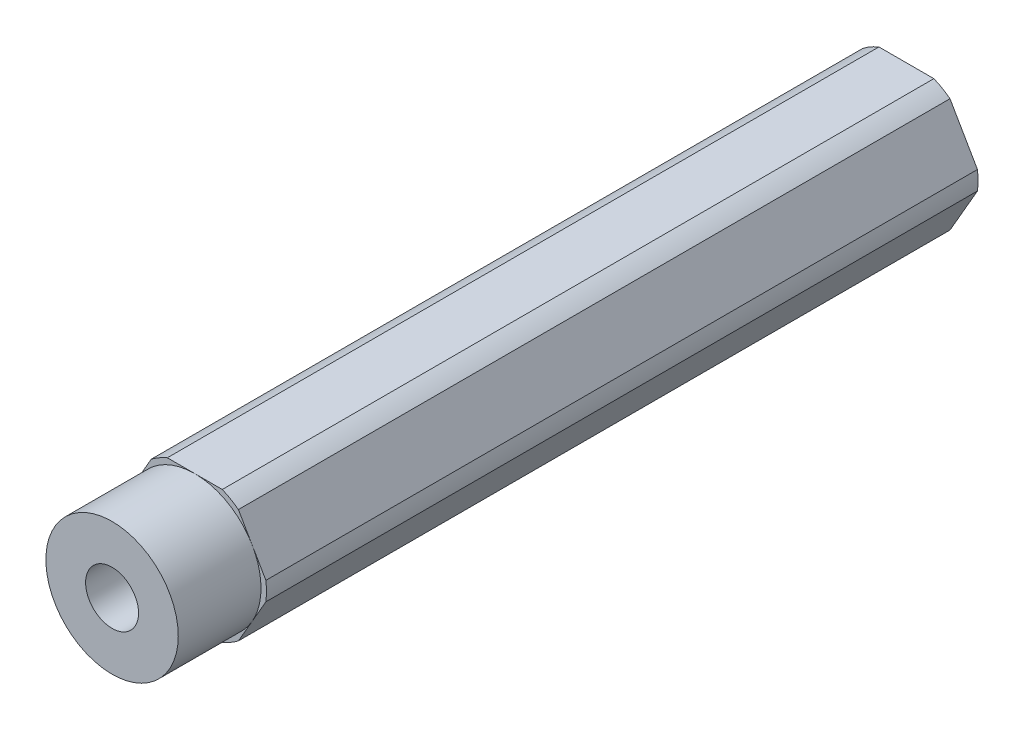
ISO-10303-21;
HEADER;
FILE_DESCRIPTION(('STEP AP214'),'2;1');
FILE_NAME('part.step','',(''),(''),'','','');
FILE_SCHEMA(('AUTOMOTIVE_DESIGN { 1 0 10303 214 1 1 1 1 }'));
ENDSEC;
DATA;
#1=APPLICATION_CONTEXT('core data for automotive mechanical design processes');
#2=APPLICATION_PROTOCOL_DEFINITION('international standard','automotive_design',2000,#1);
#3=PRODUCT_CONTEXT('',#1,'mechanical');
#4=PRODUCT('Part','Part','',(#3));
#5=PRODUCT_RELATED_PRODUCT_CATEGORY('part','',(#4));
#6=PRODUCT_DEFINITION_FORMATION('','',#4);
#7=PRODUCT_DEFINITION_CONTEXT('part definition',#1,'design');
#8=PRODUCT_DEFINITION('design','',#6,#7);
#9=PRODUCT_DEFINITION_SHAPE('','',#8);
#10=(LENGTH_UNIT() NAMED_UNIT(*) SI_UNIT(.MILLI.,.METRE.));
#11=(NAMED_UNIT(*) PLANE_ANGLE_UNIT() SI_UNIT($,.RADIAN.));
#12=(NAMED_UNIT(*) SI_UNIT($,.STERADIAN.) SOLID_ANGLE_UNIT());
#13=UNCERTAINTY_MEASURE_WITH_UNIT(LENGTH_MEASURE(1.E-05),#10,'distance_accuracy_value','');
#14=(GEOMETRIC_REPRESENTATION_CONTEXT(3) GLOBAL_UNCERTAINTY_ASSIGNED_CONTEXT((#13)) GLOBAL_UNIT_ASSIGNED_CONTEXT((#10,
#11,#12)) REPRESENTATION_CONTEXT('',''));
#15=CARTESIAN_POINT('',(0.,0.,0.));
#16=DIRECTION('',(0.,0.,1.));
#17=DIRECTION('',(1.,0.,0.));
#18=AXIS2_PLACEMENT_3D('',#15,#16,#17);
#19=CARTESIAN_POINT('',(0.,0.,76.2));
#20=DIRECTION('',(0.,0.,1.));
#21=DIRECTION('',(1.,0.,0.));
#22=AXIS2_PLACEMENT_3D('',#19,#20,#21);
#23=PLANE('',#22);
#24=CARTESIAN_POINT('',(0.,0.,76.2));
#25=DIRECTION('',(0.,0.,1.));
#26=DIRECTION('',(1.,0.,0.));
#27=AXIS2_PLACEMENT_3D('',#24,#25,#26);
#28=CIRCLE('',#27,2.54);
#29=CARTESIAN_POINT('',(2.54,0.,76.2));
#30=VERTEX_POINT('',#29);
#31=EDGE_CURVE('E195',#30,#30,#28,.T.);
#32=ORIENTED_EDGE('',*,*,#31,.F.);
#33=EDGE_LOOP('',(#32));
#34=FACE_BOUND('',#33,.T.);
#35=CARTESIAN_POINT('',(0.,0.,76.2));
#36=DIRECTION('',(0.,0.,1.));
#37=DIRECTION('',(1.,0.,0.));
#38=AXIS2_PLACEMENT_3D('',#35,#36,#37);
#39=CIRCLE('',#38,6.35);
#40=CARTESIAN_POINT('',(6.35,0.,76.2));
#41=VERTEX_POINT('',#40);
#42=EDGE_CURVE('E165',#41,#41,#39,.T.);
#43=ORIENTED_EDGE('',*,*,#42,.T.);
#44=EDGE_LOOP('',(#43));
#45=FACE_BOUND('',#44,.T.);
#46=ADVANCED_FACE('F34',(#34,#45),#23,.T.);
#47=CARTESIAN_POINT('',(0.,0.,76.2));
#48=DIRECTION('',(0.,0.,-1.));
#49=DIRECTION('',(-1.,0.,0.));
#50=AXIS2_PLACEMENT_3D('',#47,#48,#49);
#51=CYLINDRICAL_SURFACE('',#50,6.875);
#52=CARTESIAN_POINT('',(0.,0.,68.2625));
#53=DIRECTION('',(0.,0.,1.));
#54=DIRECTION('',(1.,0.,0.));
#55=AXIS2_PLACEMENT_3D('',#52,#53,#54);
#56=CIRCLE('',#55,6.875);
#57=CARTESIAN_POINT('',(-4.18177080173138,-5.45696050579321,68.2625));
#58=VERTEX_POINT('',#57);
#59=CARTESIAN_POINT('',(-2.63498102459961,-6.35,68.2625));
#60=VERTEX_POINT('',#59);
#61=EDGE_CURVE('E192',#58,#60,#56,.T.);
#62=ORIENTED_EDGE('',*,*,#61,.F.);
#63=DIRECTION('',(0.,0.,-1.));
#64=VECTOR('',#63,1.);
#65=CARTESIAN_POINT('',(-4.18177080173138,-5.45696050579321,76.2));
#66=LINE('',#65,#64);
#67=CARTESIAN_POINT('',(-4.18177080173138,-5.45696050579321,0.));
#68=VERTEX_POINT('',#67);
#69=EDGE_CURVE('E57',#58,#68,#66,.T.);
#70=ORIENTED_EDGE('',*,*,#69,.T.);
#71=CARTESIAN_POINT('',(0.,0.,0.));
#72=DIRECTION('',(0.,0.,1.));
#73=DIRECTION('',(1.,0.,0.));
#74=AXIS2_PLACEMENT_3D('',#71,#72,#73);
#75=CIRCLE('',#74,6.875);
#76=CARTESIAN_POINT('',(-2.63498102459961,-6.35,0.));
#77=VERTEX_POINT('',#76);
#78=EDGE_CURVE('E198',#68,#77,#75,.T.);
#79=ORIENTED_EDGE('',*,*,#78,.T.);
#80=DIRECTION('',(0.,0.,-1.));
#81=VECTOR('',#80,1.);
#82=CARTESIAN_POINT('',(-2.63498102459961,-6.35,76.2));
#83=LINE('',#82,#81);
#84=EDGE_CURVE('E252',#60,#77,#83,.T.);
#85=ORIENTED_EDGE('',*,*,#84,.F.);
#86=EDGE_LOOP('',(#62,#70,#79,#85));
#87=FACE_BOUND('',#86,.T.);
#88=ADVANCED_FACE('F36',(#87),#51,.T.);
#89=CARTESIAN_POINT('',(-2.63498102459961,-6.35,76.2));
#90=DIRECTION('',(0.,1.,0.));
#91=DIRECTION('',(-1.,0.,0.));
#92=AXIS2_PLACEMENT_3D('',#89,#90,#91);
#93=PLANE('',#92);
#94=DIRECTION('',(1.,0.,0.));
#95=VECTOR('',#94,1.);
#96=CARTESIAN_POINT('',(-2.63498102459961,-6.35,68.2625));
#97=LINE('',#96,#95);
#98=CARTESIAN_POINT('',(0.,-6.35,68.2625));
#99=VERTEX_POINT('',#98);
#100=EDGE_CURVE('E191',#60,#99,#97,.T.);
#101=ORIENTED_EDGE('',*,*,#100,.F.);
#102=ORIENTED_EDGE('',*,*,#84,.T.);
#103=DIRECTION('',(1.,0.,0.));
#104=VECTOR('',#103,1.);
#105=CARTESIAN_POINT('',(-2.63498102459961,-6.35,0.));
#106=LINE('',#105,#104);
#107=CARTESIAN_POINT('',(2.63498102459961,-6.35,0.));
#108=VERTEX_POINT('',#107);
#109=EDGE_CURVE('E202',#77,#108,#106,.T.);
#110=ORIENTED_EDGE('',*,*,#109,.T.);
#111=DIRECTION('',(0.,0.,-1.));
#112=VECTOR('',#111,1.);
#113=CARTESIAN_POINT('',(2.63498102459961,-6.35,76.2));
#114=LINE('',#113,#112);
#115=CARTESIAN_POINT('',(2.63498102459961,-6.35,68.2625));
#116=VERTEX_POINT('',#115);
#117=EDGE_CURVE('E251',#116,#108,#114,.T.);
#118=ORIENTED_EDGE('',*,*,#117,.F.);
#119=EDGE_CURVE('E189',#99,#116,#97,.T.);
#120=ORIENTED_EDGE('',*,*,#119,.F.);
#121=EDGE_LOOP('',(#101,#102,#110,#118,#120));
#122=FACE_BOUND('',#121,.T.);
#123=ADVANCED_FACE('F274',(#122),#93,.F.);
#124=CARTESIAN_POINT('',(0.,0.,76.2));
#125=DIRECTION('',(0.,0.,-1.));
#126=DIRECTION('',(-1.,0.,0.));
#127=AXIS2_PLACEMENT_3D('',#124,#125,#126);
#128=CYLINDRICAL_SURFACE('',#127,6.875);
#129=CARTESIAN_POINT('',(0.,0.,68.2625));
#130=DIRECTION('',(0.,0.,1.));
#131=DIRECTION('',(1.,0.,0.));
#132=AXIS2_PLACEMENT_3D('',#129,#130,#131);
#133=CIRCLE('',#132,6.875);
#134=CARTESIAN_POINT('',(4.18177080173138,-5.45696050579321,68.2625));
#135=VERTEX_POINT('',#134);
#136=EDGE_CURVE('E187',#116,#135,#133,.T.);
#137=ORIENTED_EDGE('',*,*,#136,.F.);
#138=ORIENTED_EDGE('',*,*,#117,.T.);
#139=CARTESIAN_POINT('',(0.,0.,0.));
#140=DIRECTION('',(0.,0.,1.));
#141=DIRECTION('',(1.,0.,0.));
#142=AXIS2_PLACEMENT_3D('',#139,#140,#141);
#143=CIRCLE('',#142,6.875);
#144=CARTESIAN_POINT('',(4.18177080173138,-5.45696050579321,0.));
#145=VERTEX_POINT('',#144);
#146=EDGE_CURVE('E205',#108,#145,#143,.T.);
#147=ORIENTED_EDGE('',*,*,#146,.T.);
#148=DIRECTION('',(0.,0.,-1.));
#149=VECTOR('',#148,1.);
#150=CARTESIAN_POINT('',(4.18177080173138,-5.45696050579321,76.2));
#151=LINE('',#150,#149);
#152=EDGE_CURVE('E249',#135,#145,#151,.T.);
#153=ORIENTED_EDGE('',*,*,#152,.F.);
#154=EDGE_LOOP('',(#137,#138,#147,#153));
#155=FACE_BOUND('',#154,.T.);
#156=ADVANCED_FACE('F278',(#155),#128,.T.);
#157=CARTESIAN_POINT('',(4.18177080173138,-5.45696050579321,76.2));
#158=DIRECTION('',(-0.866025403784439,0.5,0.));
#159=DIRECTION('',(-0.5,-0.866025403784439,0.));
#160=AXIS2_PLACEMENT_3D('',#157,#158,#159);
#161=PLANE('',#160);
#162=DIRECTION('',(0.5,0.866025403784439,0.));
#163=VECTOR('',#162,1.);
#164=CARTESIAN_POINT('',(4.18177080173138,-5.45696050579321,68.2625));
#165=LINE('',#164,#163);
#166=CARTESIAN_POINT('',(5.49926131403119,-3.175,68.2625));
#167=VERTEX_POINT('',#166);
#168=EDGE_CURVE('E186',#135,#167,#165,.T.);
#169=ORIENTED_EDGE('',*,*,#168,.F.);
#170=ORIENTED_EDGE('',*,*,#152,.T.);
#171=DIRECTION('',(0.5,0.866025403784439,0.));
#172=VECTOR('',#171,1.);
#173=CARTESIAN_POINT('',(4.18177080173138,-5.45696050579321,0.));
#174=LINE('',#173,#172);
#175=CARTESIAN_POINT('',(6.81675182633099,-0.89303949420679,0.));
#176=VERTEX_POINT('',#175);
#177=EDGE_CURVE('E208',#145,#176,#174,.T.);
#178=ORIENTED_EDGE('',*,*,#177,.T.);
#179=DIRECTION('',(0.,0.,-1.));
#180=VECTOR('',#179,1.);
#181=CARTESIAN_POINT('',(6.81675182633099,-0.89303949420679,76.2));
#182=LINE('',#181,#180);
#183=CARTESIAN_POINT('',(6.81675182633099,-0.89303949420679,68.2625));
#184=VERTEX_POINT('',#183);
#185=EDGE_CURVE('E247',#184,#176,#182,.T.);
#186=ORIENTED_EDGE('',*,*,#185,.F.);
#187=EDGE_CURVE('E184',#167,#184,#165,.T.);
#188=ORIENTED_EDGE('',*,*,#187,.F.);
#189=EDGE_LOOP('',(#169,#170,#178,#186,#188));
#190=FACE_BOUND('',#189,.T.);
#191=ADVANCED_FACE('F284',(#190),#161,.F.);
#192=CARTESIAN_POINT('',(0.,0.,76.2));
#193=DIRECTION('',(0.,0.,-1.));
#194=DIRECTION('',(-1.,0.,0.));
#195=AXIS2_PLACEMENT_3D('',#192,#193,#194);
#196=CYLINDRICAL_SURFACE('',#195,6.875);
#197=CARTESIAN_POINT('',(0.,0.,68.2625));
#198=DIRECTION('',(0.,0.,1.));
#199=DIRECTION('',(1.,0.,0.));
#200=AXIS2_PLACEMENT_3D('',#197,#198,#199);
#201=CIRCLE('',#200,6.875);
#202=CARTESIAN_POINT('',(6.81675182633099,0.893039494206786,68.2625));
#203=VERTEX_POINT('',#202);
#204=EDGE_CURVE('E151',#184,#203,#201,.T.);
#205=ORIENTED_EDGE('',*,*,#204,.F.);
#206=ORIENTED_EDGE('',*,*,#185,.T.);
#207=CARTESIAN_POINT('',(0.,0.,0.));
#208=DIRECTION('',(0.,0.,1.));
#209=DIRECTION('',(1.,0.,0.));
#210=AXIS2_PLACEMENT_3D('',#207,#208,#209);
#211=CIRCLE('',#210,6.875);
#212=CARTESIAN_POINT('',(6.81675182633099,0.893039494206786,0.));
#213=VERTEX_POINT('',#212);
#214=EDGE_CURVE('E211',#176,#213,#211,.T.);
#215=ORIENTED_EDGE('',*,*,#214,.T.);
#216=DIRECTION('',(0.,0.,-1.));
#217=VECTOR('',#216,1.);
#218=CARTESIAN_POINT('',(6.81675182633099,0.893039494206786,76.2));
#219=LINE('',#218,#217);
#220=EDGE_CURVE('E245',#203,#213,#219,.T.);
#221=ORIENTED_EDGE('',*,*,#220,.F.);
#222=EDGE_LOOP('',(#205,#206,#215,#221));
#223=FACE_BOUND('',#222,.T.);
#224=ADVANCED_FACE('F287',(#223),#196,.T.);
#225=CARTESIAN_POINT('',(6.81675182633099,0.893039494206785,76.2));
#226=DIRECTION('',(-0.866025403784439,-0.5,0.));
#227=DIRECTION('',(0.5,-0.866025403784439,0.));
#228=AXIS2_PLACEMENT_3D('',#225,#226,#227);
#229=PLANE('',#228);
#230=DIRECTION('',(-0.5,0.866025403784439,0.));
#231=VECTOR('',#230,1.);
#232=CARTESIAN_POINT('',(6.81675182633099,0.893039494206785,68.2625));
#233=LINE('',#232,#231);
#234=CARTESIAN_POINT('',(5.49926131403118,3.175,68.2625));
#235=VERTEX_POINT('',#234);
#236=EDGE_CURVE('E145',#203,#235,#233,.T.);
#237=ORIENTED_EDGE('',*,*,#236,.F.);
#238=ORIENTED_EDGE('',*,*,#220,.T.);
#239=DIRECTION('',(-0.5,0.866025403784438,0.));
#240=VECTOR('',#239,1.);
#241=CARTESIAN_POINT('',(6.81675182633099,0.893039494206785,0.));
#242=LINE('',#241,#240);
#243=CARTESIAN_POINT('',(4.18177080173138,5.45696050579321,0.));
#244=VERTEX_POINT('',#243);
#245=EDGE_CURVE('E214',#213,#244,#242,.T.);
#246=ORIENTED_EDGE('',*,*,#245,.T.);
#247=DIRECTION('',(0.,0.,-1.));
#248=VECTOR('',#247,1.);
#249=CARTESIAN_POINT('',(4.18177080173138,5.45696050579321,76.2));
#250=LINE('',#249,#248);
#251=CARTESIAN_POINT('',(4.18177080173138,5.45696050579321,68.2625));
#252=VERTEX_POINT('',#251);
#253=EDGE_CURVE('E178',#252,#244,#250,.T.);
#254=ORIENTED_EDGE('',*,*,#253,.F.);
#255=EDGE_CURVE('E155',#235,#252,#233,.T.);
#256=ORIENTED_EDGE('',*,*,#255,.F.);
#257=EDGE_LOOP('',(#237,#238,#246,#254,#256));
#258=FACE_BOUND('',#257,.T.);
#259=ADVANCED_FACE('F176',(#258),#229,.F.);
#260=CARTESIAN_POINT('',(0.,0.,76.2));
#261=DIRECTION('',(0.,0.,-1.));
#262=DIRECTION('',(-1.,0.,0.));
#263=AXIS2_PLACEMENT_3D('',#260,#261,#262);
#264=CYLINDRICAL_SURFACE('',#263,6.875);
#265=CARTESIAN_POINT('',(0.,0.,68.2625));
#266=DIRECTION('',(0.,0.,1.));
#267=DIRECTION('',(1.,0.,0.));
#268=AXIS2_PLACEMENT_3D('',#265,#266,#267);
#269=CIRCLE('',#268,6.875);
#270=CARTESIAN_POINT('',(2.63498102459961,6.35,68.2625));
#271=VERTEX_POINT('',#270);
#272=EDGE_CURVE('E179',#252,#271,#269,.T.);
#273=ORIENTED_EDGE('',*,*,#272,.F.);
#274=ORIENTED_EDGE('',*,*,#253,.T.);
#275=CARTESIAN_POINT('',(0.,0.,0.));
#276=DIRECTION('',(0.,0.,1.));
#277=DIRECTION('',(1.,0.,0.));
#278=AXIS2_PLACEMENT_3D('',#275,#276,#277);
#279=CIRCLE('',#278,6.875);
#280=CARTESIAN_POINT('',(2.63498102459961,6.35,0.));
#281=VERTEX_POINT('',#280);
#282=EDGE_CURVE('E216',#244,#281,#279,.T.);
#283=ORIENTED_EDGE('',*,*,#282,.T.);
#284=DIRECTION('',(0.,0.,-1.));
#285=VECTOR('',#284,1.);
#286=CARTESIAN_POINT('',(2.63498102459961,6.35,76.2));
#287=LINE('',#286,#285);
#288=EDGE_CURVE('E242',#271,#281,#287,.T.);
#289=ORIENTED_EDGE('',*,*,#288,.F.);
#290=EDGE_LOOP('',(#273,#274,#283,#289));
#291=FACE_BOUND('',#290,.T.);
#292=ADVANCED_FACE('F295',(#291),#264,.T.);
#293=CARTESIAN_POINT('',(2.63498102459961,6.35,76.2));
#294=DIRECTION('',(0.,-1.,0.));
#295=DIRECTION('',(0.,0.,-1.));
#296=AXIS2_PLACEMENT_3D('',#293,#294,#295);
#297=PLANE('',#296);
#298=DIRECTION('',(-1.,0.,0.));
#299=VECTOR('',#298,1.);
#300=CARTESIAN_POINT('',(2.63498102459961,6.35,68.2625));
#301=LINE('',#300,#299);
#302=CARTESIAN_POINT('',(0.,6.35,68.2625));
#303=VERTEX_POINT('',#302);
#304=EDGE_CURVE('E171',#271,#303,#301,.T.);
#305=ORIENTED_EDGE('',*,*,#304,.F.);
#306=ORIENTED_EDGE('',*,*,#288,.T.);
#307=DIRECTION('',(-1.,0.,0.));
#308=VECTOR('',#307,1.);
#309=CARTESIAN_POINT('',(2.63498102459961,6.35,0.));
#310=LINE('',#309,#308);
#311=CARTESIAN_POINT('',(-2.63498102459961,6.35,0.));
#312=VERTEX_POINT('',#311);
#313=EDGE_CURVE('E219',#281,#312,#310,.T.);
#314=ORIENTED_EDGE('',*,*,#313,.T.);
#315=DIRECTION('',(0.,0.,-1.));
#316=VECTOR('',#315,1.);
#317=CARTESIAN_POINT('',(-2.63498102459961,6.35,76.2));
#318=LINE('',#317,#316);
#319=CARTESIAN_POINT('',(-2.63498102459961,6.35,68.2625));
#320=VERTEX_POINT('',#319);
#321=EDGE_CURVE('E240',#320,#312,#318,.T.);
#322=ORIENTED_EDGE('',*,*,#321,.F.);
#323=EDGE_CURVE('E299',#303,#320,#301,.T.);
#324=ORIENTED_EDGE('',*,*,#323,.F.);
#325=EDGE_LOOP('',(#305,#306,#314,#322,#324));
#326=FACE_BOUND('',#325,.T.);
#327=ADVANCED_FACE('F297',(#326),#297,.F.);
#328=CARTESIAN_POINT('',(0.,0.,76.2));
#329=DIRECTION('',(0.,0.,-1.));
#330=DIRECTION('',(-1.,0.,0.));
#331=AXIS2_PLACEMENT_3D('',#328,#329,#330);
#332=CYLINDRICAL_SURFACE('',#331,6.875);
#333=CARTESIAN_POINT('',(0.,0.,68.2625));
#334=DIRECTION('',(0.,0.,1.));
#335=DIRECTION('',(1.,0.,0.));
#336=AXIS2_PLACEMENT_3D('',#333,#334,#335);
#337=CIRCLE('',#336,6.875);
#338=CARTESIAN_POINT('',(-4.18177080173138,5.45696050579321,68.2625));
#339=VERTEX_POINT('',#338);
#340=EDGE_CURVE('E300',#320,#339,#337,.T.);
#341=ORIENTED_EDGE('',*,*,#340,.F.);
#342=ORIENTED_EDGE('',*,*,#321,.T.);
#343=CARTESIAN_POINT('',(0.,0.,0.));
#344=DIRECTION('',(0.,0.,1.));
#345=DIRECTION('',(1.,0.,0.));
#346=AXIS2_PLACEMENT_3D('',#343,#344,#345);
#347=CIRCLE('',#346,6.875);
#348=CARTESIAN_POINT('',(-4.18177080173138,5.45696050579321,0.));
#349=VERTEX_POINT('',#348);
#350=EDGE_CURVE('E222',#312,#349,#347,.T.);
#351=ORIENTED_EDGE('',*,*,#350,.T.);
#352=DIRECTION('',(0.,0.,-1.));
#353=VECTOR('',#352,1.);
#354=CARTESIAN_POINT('',(-4.18177080173138,5.45696050579321,76.2));
#355=LINE('',#354,#353);
#356=EDGE_CURVE('E238',#339,#349,#355,.T.);
#357=ORIENTED_EDGE('',*,*,#356,.F.);
#358=EDGE_LOOP('',(#341,#342,#351,#357));
#359=FACE_BOUND('',#358,.T.);
#360=ADVANCED_FACE('F342',(#359),#332,.T.);
#361=CARTESIAN_POINT('',(-4.18177080173138,5.45696050579321,76.2));
#362=DIRECTION('',(0.866025403784439,-0.5,0.));
#363=DIRECTION('',(0.5,0.866025403784438,0.));
#364=AXIS2_PLACEMENT_3D('',#361,#362,#363);
#365=PLANE('',#364);
#366=DIRECTION('',(-0.5,-0.866025403784438,0.));
#367=VECTOR('',#366,1.);
#368=CARTESIAN_POINT('',(-4.18177080173138,5.45696050579321,68.2625));
#369=LINE('',#368,#367);
#370=CARTESIAN_POINT('',(-5.49926131403118,3.175,68.2625));
#371=VERTEX_POINT('',#370);
#372=EDGE_CURVE('E303',#339,#371,#369,.T.);
#373=ORIENTED_EDGE('',*,*,#372,.F.);
#374=ORIENTED_EDGE('',*,*,#356,.T.);
#375=DIRECTION('',(-0.5,-0.866025403784439,0.));
#376=VECTOR('',#375,1.);
#377=CARTESIAN_POINT('',(-4.18177080173138,5.45696050579321,0.));
#378=LINE('',#377,#376);
#379=CARTESIAN_POINT('',(-6.81675182633099,0.893039494206786,0.));
#380=VERTEX_POINT('',#379);
#381=EDGE_CURVE('E225',#349,#380,#378,.T.);
#382=ORIENTED_EDGE('',*,*,#381,.T.);
#383=DIRECTION('',(0.,0.,-1.));
#384=VECTOR('',#383,1.);
#385=CARTESIAN_POINT('',(-6.81675182633099,0.893039494206786,76.2));
#386=LINE('',#385,#384);
#387=CARTESIAN_POINT('',(-6.81675182633099,0.893039494206786,68.2625));
#388=VERTEX_POINT('',#387);
#389=EDGE_CURVE('E236',#388,#380,#386,.T.);
#390=ORIENTED_EDGE('',*,*,#389,.F.);
#391=EDGE_CURVE('E304',#371,#388,#369,.T.);
#392=ORIENTED_EDGE('',*,*,#391,.F.);
#393=EDGE_LOOP('',(#373,#374,#382,#390,#392));
#394=FACE_BOUND('',#393,.T.);
#395=ADVANCED_FACE('F338',(#394),#365,.F.);
#396=CARTESIAN_POINT('',(0.,0.,76.2));
#397=DIRECTION('',(0.,0.,-1.));
#398=DIRECTION('',(-1.,0.,0.));
#399=AXIS2_PLACEMENT_3D('',#396,#397,#398);
#400=CYLINDRICAL_SURFACE('',#399,6.875);
#401=CARTESIAN_POINT('',(0.,0.,68.2625));
#402=DIRECTION('',(0.,0.,1.));
#403=DIRECTION('',(1.,0.,0.));
#404=AXIS2_PLACEMENT_3D('',#401,#402,#403);
#405=CIRCLE('',#404,6.875);
#406=CARTESIAN_POINT('',(-6.81675182633099,-0.893039494206782,68.2625));
#407=VERTEX_POINT('',#406);
#408=EDGE_CURVE('E173',#388,#407,#405,.T.);
#409=ORIENTED_EDGE('',*,*,#408,.F.);
#410=ORIENTED_EDGE('',*,*,#389,.T.);
#411=CARTESIAN_POINT('',(0.,0.,0.));
#412=DIRECTION('',(0.,0.,1.));
#413=DIRECTION('',(1.,0.,0.));
#414=AXIS2_PLACEMENT_3D('',#411,#412,#413);
#415=CIRCLE('',#414,6.875);
#416=CARTESIAN_POINT('',(-6.81675182633099,-0.893039494206782,0.));
#417=VERTEX_POINT('',#416);
#418=EDGE_CURVE('E228',#380,#417,#415,.T.);
#419=ORIENTED_EDGE('',*,*,#418,.T.);
#420=DIRECTION('',(0.,0.,-1.));
#421=VECTOR('',#420,1.);
#422=CARTESIAN_POINT('',(-6.81675182633099,-0.893039494206782,76.2));
#423=LINE('',#422,#421);
#424=EDGE_CURVE('E234',#407,#417,#423,.T.);
#425=ORIENTED_EDGE('',*,*,#424,.F.);
#426=EDGE_LOOP('',(#409,#410,#419,#425));
#427=FACE_BOUND('',#426,.T.);
#428=ADVANCED_FACE('F335',(#427),#400,.T.);
#429=CARTESIAN_POINT('',(-6.81675182633099,-0.893039494206782,76.2));
#430=DIRECTION('',(0.866025403784439,0.5,0.));
#431=DIRECTION('',(-0.5,0.866025403784439,0.));
#432=AXIS2_PLACEMENT_3D('',#429,#430,#431);
#433=PLANE('',#432);
#434=DIRECTION('',(0.5,-0.866025403784439,0.));
#435=VECTOR('',#434,1.);
#436=CARTESIAN_POINT('',(-6.81675182633099,-0.893039494206782,68.2625));
#437=LINE('',#436,#435);
#438=CARTESIAN_POINT('',(-5.49926131403119,-3.175,68.2625));
#439=VERTEX_POINT('',#438);
#440=EDGE_CURVE('E12',#407,#439,#437,.T.);
#441=ORIENTED_EDGE('',*,*,#440,.F.);
#442=ORIENTED_EDGE('',*,*,#424,.T.);
#443=DIRECTION('',(0.5,-0.866025403784439,0.));
#444=VECTOR('',#443,1.);
#445=CARTESIAN_POINT('',(-6.81675182633099,-0.893039494206782,0.));
#446=LINE('',#445,#444);
#447=EDGE_CURVE('E231',#417,#68,#446,.T.);
#448=ORIENTED_EDGE('',*,*,#447,.T.);
#449=ORIENTED_EDGE('',*,*,#69,.F.);
#450=EDGE_CURVE('E38',#439,#58,#437,.T.);
#451=ORIENTED_EDGE('',*,*,#450,.F.);
#452=EDGE_LOOP('',(#441,#442,#448,#449,#451));
#453=FACE_BOUND('',#452,.T.);
#454=ADVANCED_FACE('F263',(#453),#433,.F.);
#455=CARTESIAN_POINT('',(0.,0.,0.));
#456=DIRECTION('',(0.,0.,1.));
#457=DIRECTION('',(1.,0.,0.));
#458=AXIS2_PLACEMENT_3D('',#455,#456,#457);
#459=PLANE('',#458);
#460=ORIENTED_EDGE('',*,*,#78,.F.);
#461=ORIENTED_EDGE('',*,*,#447,.F.);
#462=ORIENTED_EDGE('',*,*,#418,.F.);
#463=ORIENTED_EDGE('',*,*,#381,.F.);
#464=ORIENTED_EDGE('',*,*,#350,.F.);
#465=ORIENTED_EDGE('',*,*,#313,.F.);
#466=ORIENTED_EDGE('',*,*,#282,.F.);
#467=ORIENTED_EDGE('',*,*,#245,.F.);
#468=ORIENTED_EDGE('',*,*,#214,.F.);
#469=ORIENTED_EDGE('',*,*,#177,.F.);
#470=ORIENTED_EDGE('',*,*,#146,.F.);
#471=ORIENTED_EDGE('',*,*,#109,.F.);
#472=EDGE_LOOP('',(#460,#461,#462,#463,#464,#465,#466,#467,#468,#469,#470,#471));
#473=FACE_BOUND('',#472,.T.);
#474=CARTESIAN_POINT('',(0.,0.,0.));
#475=DIRECTION('',(0.,0.,1.));
#476=DIRECTION('',(1.,0.,0.));
#477=AXIS2_PLACEMENT_3D('',#474,#475,#476);
#478=CIRCLE('',#477,2.54);
#479=CARTESIAN_POINT('',(2.54,0.,0.));
#480=VERTEX_POINT('',#479);
#481=EDGE_CURVE('E194',#480,#480,#478,.T.);
#482=ORIENTED_EDGE('',*,*,#481,.T.);
#483=EDGE_LOOP('',(#482));
#484=FACE_BOUND('',#483,.T.);
#485=ADVANCED_FACE('F269',(#473,#484),#459,.F.);
#486=CARTESIAN_POINT('',(0.,0.,76.2));
#487=DIRECTION('',(0.,0.,-1.));
#488=DIRECTION('',(-1.,0.,0.));
#489=AXIS2_PLACEMENT_3D('',#486,#487,#488);
#490=CYLINDRICAL_SURFACE('',#489,2.54);
#491=ORIENTED_EDGE('',*,*,#31,.T.);
#492=EDGE_LOOP('',(#491));
#493=FACE_BOUND('',#492,.T.);
#494=ORIENTED_EDGE('',*,*,#481,.F.);
#495=EDGE_LOOP('',(#494));
#496=FACE_BOUND('',#495,.T.);
#497=ADVANCED_FACE('F330',(#493,#496),#490,.F.);
#498=CARTESIAN_POINT('',(0.,0.,68.2625));
#499=DIRECTION('',(0.,0.,1.));
#500=DIRECTION('',(1.,0.,0.));
#501=AXIS2_PLACEMENT_3D('',#498,#499,#500);
#502=PLANE('',#501);
#503=ORIENTED_EDGE('',*,*,#61,.T.);
#504=ORIENTED_EDGE('',*,*,#100,.T.);
#505=CARTESIAN_POINT('',(0.,0.,68.2625));
#506=DIRECTION('',(0.,0.,1.));
#507=DIRECTION('',(1.,0.,0.));
#508=AXIS2_PLACEMENT_3D('',#505,#506,#507);
#509=CIRCLE('',#508,6.35);
#510=EDGE_CURVE('E260',#439,#99,#509,.T.);
#511=ORIENTED_EDGE('',*,*,#510,.F.);
#512=ORIENTED_EDGE('',*,*,#450,.T.);
#513=EDGE_LOOP('',(#503,#504,#511,#512));
#514=FACE_BOUND('',#513,.T.);
#515=ADVANCED_FACE('F259',(#514),#502,.T.);
#516=ORIENTED_EDGE('',*,*,#119,.T.);
#517=ORIENTED_EDGE('',*,*,#136,.T.);
#518=ORIENTED_EDGE('',*,*,#168,.T.);
#519=EDGE_CURVE('E163',#99,#167,#509,.T.);
#520=ORIENTED_EDGE('',*,*,#519,.F.);
#521=EDGE_LOOP('',(#516,#517,#518,#520));
#522=FACE_BOUND('',#521,.T.);
#523=ADVANCED_FACE('F282',(#522),#502,.T.);
#524=ORIENTED_EDGE('',*,*,#187,.T.);
#525=ORIENTED_EDGE('',*,*,#204,.T.);
#526=ORIENTED_EDGE('',*,*,#236,.T.);
#527=EDGE_CURVE('E148',#167,#235,#509,.T.);
#528=ORIENTED_EDGE('',*,*,#527,.F.);
#529=EDGE_LOOP('',(#524,#525,#526,#528));
#530=FACE_BOUND('',#529,.T.);
#531=ADVANCED_FACE('F147',(#530),#502,.T.);
#532=ORIENTED_EDGE('',*,*,#255,.T.);
#533=ORIENTED_EDGE('',*,*,#272,.T.);
#534=ORIENTED_EDGE('',*,*,#304,.T.);
#535=EDGE_CURVE('E160',#235,#303,#509,.T.);
#536=ORIENTED_EDGE('',*,*,#535,.F.);
#537=EDGE_LOOP('',(#532,#533,#534,#536));
#538=FACE_BOUND('',#537,.T.);
#539=ADVANCED_FACE('F168',(#538),#502,.T.);
#540=ORIENTED_EDGE('',*,*,#323,.T.);
#541=ORIENTED_EDGE('',*,*,#340,.T.);
#542=ORIENTED_EDGE('',*,*,#372,.T.);
#543=EDGE_CURVE('E174',#303,#371,#509,.T.);
#544=ORIENTED_EDGE('',*,*,#543,.F.);
#545=EDGE_LOOP('',(#540,#541,#542,#544));
#546=FACE_BOUND('',#545,.T.);
#547=ADVANCED_FACE('F317',(#546),#502,.T.);
#548=ORIENTED_EDGE('',*,*,#391,.T.);
#549=ORIENTED_EDGE('',*,*,#408,.T.);
#550=ORIENTED_EDGE('',*,*,#440,.T.);
#551=EDGE_CURVE('E49',#371,#439,#509,.T.);
#552=ORIENTED_EDGE('',*,*,#551,.F.);
#553=EDGE_LOOP('',(#548,#549,#550,#552));
#554=FACE_BOUND('',#553,.T.);
#555=ADVANCED_FACE('F312',(#554),#502,.T.);
#556=CARTESIAN_POINT('',(0.,0.,68.2625));
#557=DIRECTION('',(0.,0.,1.));
#558=DIRECTION('',(1.,0.,0.));
#559=AXIS2_PLACEMENT_3D('',#556,#557,#558);
#560=CYLINDRICAL_SURFACE('',#559,6.35);
#561=ORIENTED_EDGE('',*,*,#42,.F.);
#562=EDGE_LOOP('',(#561));
#563=FACE_BOUND('',#562,.T.);
#564=ORIENTED_EDGE('',*,*,#510,.T.);
#565=ORIENTED_EDGE('',*,*,#519,.T.);
#566=ORIENTED_EDGE('',*,*,#527,.T.);
#567=ORIENTED_EDGE('',*,*,#535,.T.);
#568=ORIENTED_EDGE('',*,*,#543,.T.);
#569=ORIENTED_EDGE('',*,*,#551,.T.);
#570=EDGE_LOOP('',(#564,#565,#566,#567,#568,#569));
#571=FACE_BOUND('',#570,.T.);
#572=ADVANCED_FACE('F159',(#563,#571),#560,.T.);
#573=CLOSED_SHELL('',(#46,#88,#123,#156,#191,#224,#259,#292,#327,#360,#395,#428,#454,#485,#497,
#515,#523,#531,#539,#547,#555,#572));
#574=MANIFOLD_SOLID_BREP('B2',#573);
#575=ADVANCED_BREP_SHAPE_REPRESENTATION('',(#18,#574),#14);
#576=SHAPE_DEFINITION_REPRESENTATION(#9,#575);
ENDSEC;
END-ISO-10303-21;
